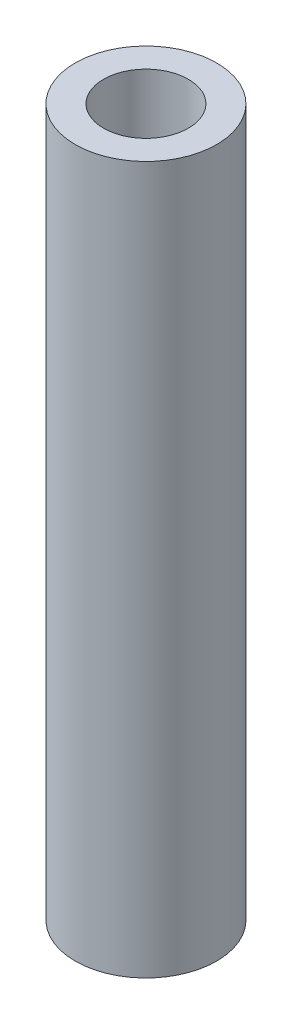
ISO-10303-21;
HEADER;
FILE_DESCRIPTION(('STEP AP214'),'2;1');
FILE_NAME('part.step','',(''),(''),'','','');
FILE_SCHEMA(('AUTOMOTIVE_DESIGN { 1 0 10303 214 1 1 1 1 }'));
ENDSEC;
DATA;
#1=APPLICATION_CONTEXT('core data for automotive mechanical design processes');
#2=APPLICATION_PROTOCOL_DEFINITION('international standard','automotive_design',2000,#1);
#3=PRODUCT_CONTEXT('',#1,'mechanical');
#4=PRODUCT('Part','Part','',(#3));
#5=PRODUCT_RELATED_PRODUCT_CATEGORY('part','',(#4));
#6=PRODUCT_DEFINITION_FORMATION('','',#4);
#7=PRODUCT_DEFINITION_CONTEXT('part definition',#1,'design');
#8=PRODUCT_DEFINITION('design','',#6,#7);
#9=PRODUCT_DEFINITION_SHAPE('','',#8);
#10=(LENGTH_UNIT() NAMED_UNIT(*) SI_UNIT(.MILLI.,.METRE.));
#11=(NAMED_UNIT(*) PLANE_ANGLE_UNIT() SI_UNIT($,.RADIAN.));
#12=(NAMED_UNIT(*) SI_UNIT($,.STERADIAN.) SOLID_ANGLE_UNIT());
#13=UNCERTAINTY_MEASURE_WITH_UNIT(LENGTH_MEASURE(1.E-05),#10,'distance_accuracy_value','');
#14=(GEOMETRIC_REPRESENTATION_CONTEXT(3) GLOBAL_UNCERTAINTY_ASSIGNED_CONTEXT((#13)) GLOBAL_UNIT_ASSIGNED_CONTEXT((#10,
#11,#12)) REPRESENTATION_CONTEXT('',''));
#15=CARTESIAN_POINT('',(0.,0.,0.));
#16=DIRECTION('',(0.,0.,1.));
#17=DIRECTION('',(1.,0.,0.));
#18=AXIS2_PLACEMENT_3D('',#15,#16,#17);
#19=CARTESIAN_POINT('',(0.,25.,0.));
#20=DIRECTION('',(0.,1.,0.));
#21=DIRECTION('',(0.,0.,1.));
#22=AXIS2_PLACEMENT_3D('',#19,#20,#21);
#23=PLANE('',#22);
#24=CARTESIAN_POINT('',(0.,25.,0.));
#25=DIRECTION('',(0.,1.,0.));
#26=DIRECTION('',(0.,0.,1.));
#27=AXIS2_PLACEMENT_3D('',#24,#25,#26);
#28=CIRCLE('',#27,2.5);
#29=CARTESIAN_POINT('',(0.,25.,2.5));
#30=VERTEX_POINT('',#29);
#31=EDGE_CURVE('E10',#30,#30,#28,.T.);
#32=ORIENTED_EDGE('',*,*,#31,.T.);
#33=EDGE_LOOP('',(#32));
#34=FACE_BOUND('',#33,.T.);
#35=CARTESIAN_POINT('',(0.,25.,0.));
#36=DIRECTION('',(0.,1.,0.));
#37=DIRECTION('',(0.,0.,1.));
#38=AXIS2_PLACEMENT_3D('',#35,#36,#37);
#39=CIRCLE('',#38,1.5);
#40=CARTESIAN_POINT('',(0.,25.,1.5));
#41=VERTEX_POINT('',#40);
#42=EDGE_CURVE('E50',#41,#41,#39,.T.);
#43=ORIENTED_EDGE('',*,*,#42,.F.);
#44=EDGE_LOOP('',(#43));
#45=FACE_BOUND('',#44,.T.);
#46=ADVANCED_FACE('F37',(#34,#45),#23,.T.);
#47=CARTESIAN_POINT('',(0.,0.,0.));
#48=DIRECTION('',(0.,1.,0.));
#49=DIRECTION('',(0.,0.,1.));
#50=AXIS2_PLACEMENT_3D('',#47,#48,#49);
#51=PLANE('',#50);
#52=CARTESIAN_POINT('',(0.,0.,0.));
#53=DIRECTION('',(0.,1.,0.));
#54=DIRECTION('',(0.,0.,1.));
#55=AXIS2_PLACEMENT_3D('',#52,#53,#54);
#56=CIRCLE('',#55,2.5);
#57=CARTESIAN_POINT('',(0.,0.,2.5));
#58=VERTEX_POINT('',#57);
#59=EDGE_CURVE('E41',#58,#58,#56,.T.);
#60=ORIENTED_EDGE('',*,*,#59,.F.);
#61=EDGE_LOOP('',(#60));
#62=FACE_BOUND('',#61,.T.);
#63=CARTESIAN_POINT('',(0.,0.,0.));
#64=DIRECTION('',(0.,1.,0.));
#65=DIRECTION('',(0.,0.,1.));
#66=AXIS2_PLACEMENT_3D('',#63,#64,#65);
#67=CIRCLE('',#66,1.5);
#68=CARTESIAN_POINT('',(0.,0.,1.5));
#69=VERTEX_POINT('',#68);
#70=EDGE_CURVE('E52',#69,#69,#67,.T.);
#71=ORIENTED_EDGE('',*,*,#70,.T.);
#72=EDGE_LOOP('',(#71));
#73=FACE_BOUND('',#72,.T.);
#74=ADVANCED_FACE('F64',(#62,#73),#51,.F.);
#75=CARTESIAN_POINT('',(0.,25.,0.));
#76=DIRECTION('',(0.,-1.,0.));
#77=DIRECTION('',(0.,0.,-1.));
#78=AXIS2_PLACEMENT_3D('',#75,#76,#77);
#79=CYLINDRICAL_SURFACE('',#78,2.5);
#80=ORIENTED_EDGE('',*,*,#31,.F.);
#81=EDGE_LOOP('',(#80));
#82=FACE_BOUND('',#81,.T.);
#83=ORIENTED_EDGE('',*,*,#59,.T.);
#84=EDGE_LOOP('',(#83));
#85=FACE_BOUND('',#84,.T.);
#86=ADVANCED_FACE('F39',(#82,#85),#79,.T.);
#87=CARTESIAN_POINT('',(0.,25.,0.));
#88=DIRECTION('',(0.,-1.,0.));
#89=DIRECTION('',(0.,0.,-1.));
#90=AXIS2_PLACEMENT_3D('',#87,#88,#89);
#91=CYLINDRICAL_SURFACE('',#90,1.5);
#92=ORIENTED_EDGE('',*,*,#42,.T.);
#93=EDGE_LOOP('',(#92));
#94=FACE_BOUND('',#93,.T.);
#95=ORIENTED_EDGE('',*,*,#70,.F.);
#96=EDGE_LOOP('',(#95));
#97=FACE_BOUND('',#96,.T.);
#98=ADVANCED_FACE('F60',(#94,#97),#91,.F.);
#99=CLOSED_SHELL('',(#46,#74,#86,#98));
#100=MANIFOLD_SOLID_BREP('B2',#99);
#101=ADVANCED_BREP_SHAPE_REPRESENTATION('',(#18,#100),#14);
#102=SHAPE_DEFINITION_REPRESENTATION(#9,#101);
ENDSEC;
END-ISO-10303-21;
